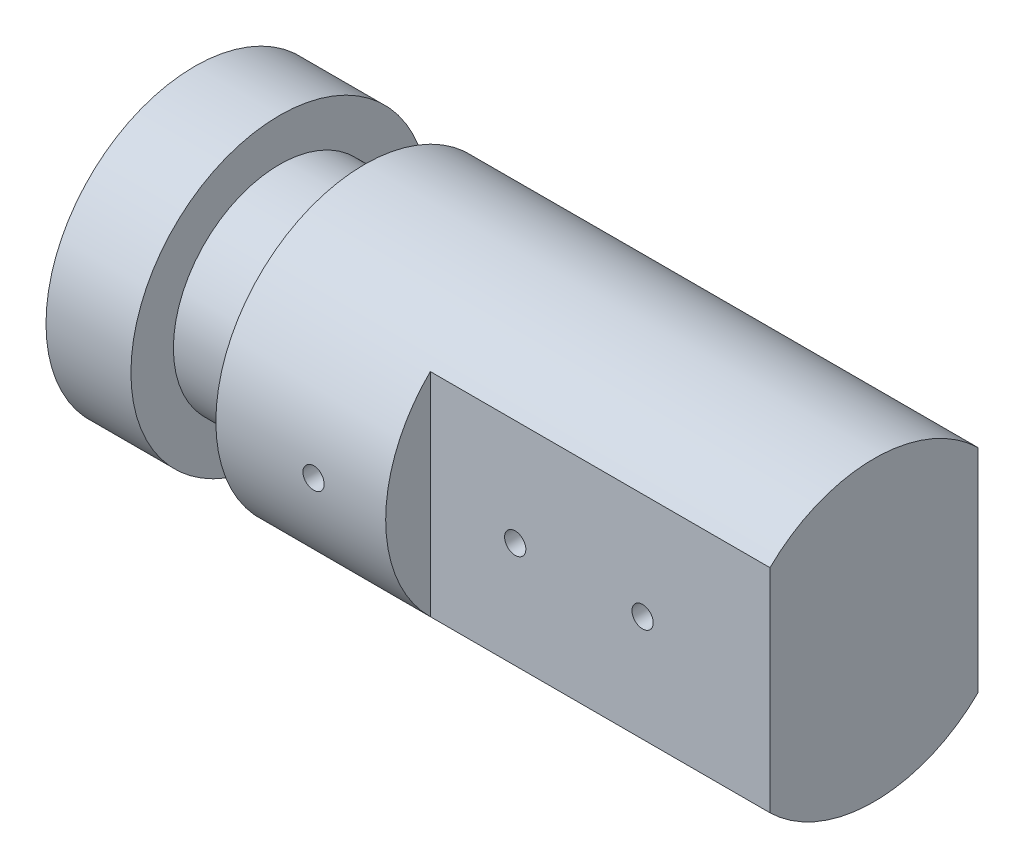
ISO-10303-21;
HEADER;
FILE_DESCRIPTION(('STEP AP214'),'2;1');
FILE_NAME('part.step','',(''),(''),'','','');
FILE_SCHEMA(('AUTOMOTIVE_DESIGN { 1 0 10303 214 1 1 1 1 }'));
ENDSEC;
DATA;
#1=APPLICATION_CONTEXT('core data for automotive mechanical design processes');
#2=APPLICATION_PROTOCOL_DEFINITION('international standard','automotive_design',2000,#1);
#3=PRODUCT_CONTEXT('',#1,'mechanical');
#4=PRODUCT('Part','Part','',(#3));
#5=PRODUCT_RELATED_PRODUCT_CATEGORY('part','',(#4));
#6=PRODUCT_DEFINITION_FORMATION('','',#4);
#7=PRODUCT_DEFINITION_CONTEXT('part definition',#1,'design');
#8=PRODUCT_DEFINITION('design','',#6,#7);
#9=PRODUCT_DEFINITION_SHAPE('','',#8);
#10=(LENGTH_UNIT() NAMED_UNIT(*) SI_UNIT(.MILLI.,.METRE.));
#11=(NAMED_UNIT(*) PLANE_ANGLE_UNIT() SI_UNIT($,.RADIAN.));
#12=(NAMED_UNIT(*) SI_UNIT($,.STERADIAN.) SOLID_ANGLE_UNIT());
#13=UNCERTAINTY_MEASURE_WITH_UNIT(LENGTH_MEASURE(1.E-05),#10,'distance_accuracy_value','');
#14=(GEOMETRIC_REPRESENTATION_CONTEXT(3) GLOBAL_UNCERTAINTY_ASSIGNED_CONTEXT((#13)) GLOBAL_UNIT_ASSIGNED_CONTEXT((#10,
#11,#12)) REPRESENTATION_CONTEXT('',''));
#15=CARTESIAN_POINT('',(0.,0.,0.));
#16=DIRECTION('',(0.,0.,1.));
#17=DIRECTION('',(1.,0.,0.));
#18=AXIS2_PLACEMENT_3D('',#15,#16,#17);
#19=CARTESIAN_POINT('',(40.,17.5,0.));
#20=DIRECTION('',(-1.,0.,0.));
#21=DIRECTION('',(0.,0.,1.));
#22=AXIS2_PLACEMENT_3D('',#19,#20,#21);
#23=PLANE('',#22);
#24=DIRECTION('',(0.,-1.,0.));
#25=VECTOR('',#24,1.);
#26=CARTESIAN_POINT('',(40.,-12.5,12.2474487139159));
#27=LINE('',#26,#25);
#28=CARTESIAN_POINT('',(40.,12.5,12.2474487139159));
#29=VERTEX_POINT('',#28);
#30=CARTESIAN_POINT('',(40.,-12.5,12.2474487139159));
#31=VERTEX_POINT('',#30);
#32=EDGE_CURVE('E139',#29,#31,#27,.T.);
#33=ORIENTED_EDGE('',*,*,#32,.F.);
#34=CARTESIAN_POINT('',(40.,0.,0.));
#35=DIRECTION('',(-1.,0.,0.));
#36=DIRECTION('',(0.,0.,1.));
#37=AXIS2_PLACEMENT_3D('',#34,#35,#36);
#38=CIRCLE('',#37,17.5);
#39=EDGE_CURVE('E62',#31,#29,#38,.T.);
#40=ORIENTED_EDGE('',*,*,#39,.F.);
#41=EDGE_LOOP('',(#33,#40));
#42=FACE_BOUND('',#41,.T.);
#43=ADVANCED_FACE('F43',(#42),#23,.F.);
#44=DIRECTION('',(0.,1.,0.));
#45=VECTOR('',#44,1.);
#46=CARTESIAN_POINT('',(40.,-12.5,-12.2474487139159));
#47=LINE('',#46,#45);
#48=CARTESIAN_POINT('',(40.,-12.5,-12.2474487139159));
#49=VERTEX_POINT('',#48);
#50=CARTESIAN_POINT('',(40.,12.5,-12.2474487139159));
#51=VERTEX_POINT('',#50);
#52=EDGE_CURVE('E69',#49,#51,#47,.T.);
#53=ORIENTED_EDGE('',*,*,#52,.F.);
#54=EDGE_CURVE('E163',#51,#49,#38,.T.);
#55=ORIENTED_EDGE('',*,*,#54,.F.);
#56=EDGE_LOOP('',(#53,#55));
#57=FACE_BOUND('',#56,.T.);
#58=ADVANCED_FACE('F235',(#57),#23,.F.);
#59=CARTESIAN_POINT('',(0.,0.,0.));
#60=DIRECTION('',(1.,0.,0.));
#61=DIRECTION('',(0.,0.,-1.));
#62=AXIS2_PLACEMENT_3D('',#59,#60,#61);
#63=PLANE('',#62);
#64=CARTESIAN_POINT('',(0.,0.,0.));
#65=DIRECTION('',(-1.,0.,0.));
#66=DIRECTION('',(0.,0.,1.));
#67=AXIS2_PLACEMENT_3D('',#64,#65,#66);
#68=CIRCLE('',#67,17.5);
#69=CARTESIAN_POINT('',(0.,0.,17.5));
#70=VERTEX_POINT('',#69);
#71=EDGE_CURVE('E56',#70,#70,#68,.T.);
#72=ORIENTED_EDGE('',*,*,#71,.T.);
#73=EDGE_LOOP('',(#72));
#74=FACE_BOUND('',#73,.T.);
#75=ADVANCED_FACE('F45',(#74),#63,.F.);
#76=CARTESIAN_POINT('',(0.,0.,0.));
#77=DIRECTION('',(-1.,0.,0.));
#78=DIRECTION('',(0.,0.,1.));
#79=AXIS2_PLACEMENT_3D('',#76,#77,#78);
#80=CYLINDRICAL_SURFACE('',#79,17.5);
#81=ORIENTED_EDGE('',*,*,#71,.F.);
#82=EDGE_LOOP('',(#81));
#83=FACE_BOUND('',#82,.T.);
#84=CARTESIAN_POINT('',(10.,0.,0.));
#85=DIRECTION('',(-1.,0.,0.));
#86=DIRECTION('',(0.,0.,1.));
#87=AXIS2_PLACEMENT_3D('',#84,#85,#86);
#88=CIRCLE('',#87,17.5);
#89=CARTESIAN_POINT('',(10.,0.,17.5));
#90=VERTEX_POINT('',#89);
#91=EDGE_CURVE('E173',#90,#90,#88,.T.);
#92=ORIENTED_EDGE('',*,*,#91,.T.);
#93=EDGE_LOOP('',(#92));
#94=FACE_BOUND('',#93,.T.);
#95=ADVANCED_FACE('F179',(#83,#94),#80,.T.);
#96=CARTESIAN_POINT('',(10.,17.5,0.));
#97=DIRECTION('',(-1.,0.,0.));
#98=DIRECTION('',(0.,0.,1.));
#99=AXIS2_PLACEMENT_3D('',#96,#97,#98);
#100=PLANE('',#99);
#101=ORIENTED_EDGE('',*,*,#91,.F.);
#102=EDGE_LOOP('',(#101));
#103=FACE_BOUND('',#102,.T.);
#104=CARTESIAN_POINT('',(10.,0.,0.));
#105=DIRECTION('',(-1.,0.,0.));
#106=DIRECTION('',(0.,0.,1.));
#107=AXIS2_PLACEMENT_3D('',#104,#105,#106);
#108=CIRCLE('',#107,12.5);
#109=CARTESIAN_POINT('',(10.,0.,12.5));
#110=VERTEX_POINT('',#109);
#111=EDGE_CURVE('E170',#110,#110,#108,.T.);
#112=ORIENTED_EDGE('',*,*,#111,.T.);
#113=EDGE_LOOP('',(#112));
#114=FACE_BOUND('',#113,.T.);
#115=ADVANCED_FACE('F182',(#103,#114),#100,.F.);
#116=CARTESIAN_POINT('',(0.,0.,0.));
#117=DIRECTION('',(-1.,0.,0.));
#118=DIRECTION('',(0.,0.,1.));
#119=AXIS2_PLACEMENT_3D('',#116,#117,#118);
#120=CYLINDRICAL_SURFACE('',#119,12.5);
#121=ORIENTED_EDGE('',*,*,#111,.F.);
#122=EDGE_LOOP('',(#121));
#123=FACE_BOUND('',#122,.T.);
#124=CARTESIAN_POINT('',(20.,0.,0.));
#125=DIRECTION('',(-1.,0.,0.));
#126=DIRECTION('',(0.,0.,1.));
#127=AXIS2_PLACEMENT_3D('',#124,#125,#126);
#128=CIRCLE('',#127,12.5);
#129=CARTESIAN_POINT('',(20.,0.,12.5));
#130=VERTEX_POINT('',#129);
#131=EDGE_CURVE('E167',#130,#130,#128,.T.);
#132=ORIENTED_EDGE('',*,*,#131,.T.);
#133=EDGE_LOOP('',(#132));
#134=FACE_BOUND('',#133,.T.);
#135=ADVANCED_FACE('F187',(#123,#134),#120,.T.);
#136=CARTESIAN_POINT('',(20.,12.5,0.));
#137=DIRECTION('',(1.,0.,0.));
#138=DIRECTION('',(0.,0.,-1.));
#139=AXIS2_PLACEMENT_3D('',#136,#137,#138);
#140=PLANE('',#139);
#141=ORIENTED_EDGE('',*,*,#131,.F.);
#142=EDGE_LOOP('',(#141));
#143=FACE_BOUND('',#142,.T.);
#144=CARTESIAN_POINT('',(20.,0.,0.));
#145=DIRECTION('',(-1.,0.,0.));
#146=DIRECTION('',(0.,0.,1.));
#147=AXIS2_PLACEMENT_3D('',#144,#145,#146);
#148=CIRCLE('',#147,17.5);
#149=CARTESIAN_POINT('',(20.,0.,17.5));
#150=VERTEX_POINT('',#149);
#151=EDGE_CURVE('E164',#150,#150,#148,.T.);
#152=ORIENTED_EDGE('',*,*,#151,.T.);
#153=EDGE_LOOP('',(#152));
#154=FACE_BOUND('',#153,.T.);
#155=ADVANCED_FACE('F193',(#143,#154),#140,.F.);
#156=CARTESIAN_POINT('',(0.,0.,0.));
#157=DIRECTION('',(-1.,0.,0.));
#158=DIRECTION('',(0.,0.,1.));
#159=AXIS2_PLACEMENT_3D('',#156,#157,#158);
#160=CYLINDRICAL_SURFACE('',#159,17.5);
#161=CARTESIAN_POINT('',(32.75,0.,17.5));
#162=CARTESIAN_POINT('',(32.7499969233431,-0.070117149484496,17.4999994098506));
#163=CARTESIAN_POINT('',(32.7440804696194,-0.14028285863724,17.4995740919418));
#164=CARTESIAN_POINT('',(32.7205643479706,-0.278675303534782,17.4979183052357));
#165=CARTESIAN_POINT('',(32.7029512242305,-0.346899711636264,17.4966869091517));
#166=CARTESIAN_POINT('',(32.6565515979996,-0.479385006592123,17.4935582109521));
#167=CARTESIAN_POINT('',(32.6277711585204,-0.543648022281689,17.4916612702305));
#168=CARTESIAN_POINT('',(32.5598641138372,-0.666414750875718,17.4874145906709));
#169=CARTESIAN_POINT('',(32.5207398163751,-0.724919744419837,17.4850649528624));
#170=CARTESIAN_POINT('',(32.4331742845642,-0.834637788743854,17.4801717877561));
#171=CARTESIAN_POINT('',(32.3847174095898,-0.885838343544007,17.4776279393593));
#172=CARTESIAN_POINT('',(32.2798948955976,-0.979387078070438,17.4726357811445));
#173=CARTESIAN_POINT('',(32.22352891975,-1.02173488058784,17.4701874754011));
#174=CARTESIAN_POINT('',(32.1044150214231,-1.09641641107241,17.4656599469621));
#175=CARTESIAN_POINT('',(32.0416603873636,-1.12873946032465,17.4635811188462));
#176=CARTESIAN_POINT('',(31.9115974789935,-1.18238568562317,17.4600312453635));
#177=CARTESIAN_POINT('',(31.8442892659998,-1.20370900975475,17.4585601918145));
#178=CARTESIAN_POINT('',(31.7071526806214,-1.23471502929159,17.4563948876015));
#179=CARTESIAN_POINT('',(31.6373288458564,-1.24441769955694,17.4556993041169));
#180=CARTESIAN_POINT('',(31.4970403999725,-1.25196866993374,17.4551593949022));
#181=CARTESIAN_POINT('',(31.4265757979994,-1.24981713898019,17.4553150570408));
#182=CARTESIAN_POINT('',(31.2871424603873,-1.23373732602158,17.4564588484088));
#183=CARTESIAN_POINT('',(31.2181712135936,-1.21983069503747,17.4574454471734));
#184=CARTESIAN_POINT('',(31.0835444608037,-1.18066904472906,17.4601375305538));
#185=CARTESIAN_POINT('',(31.0178889796267,-1.15541394047235,17.46184302055));
#186=CARTESIAN_POINT('',(30.8916881327436,-1.09424779641099,17.4657824650415));
#187=CARTESIAN_POINT('',(30.8311475224627,-1.05832697746606,17.4680169041348));
#188=CARTESIAN_POINT('',(30.7169469354921,-0.976856133947523,17.4727619896942));
#189=CARTESIAN_POINT('',(30.6632870606117,-0.931305966922026,17.475272640246));
#190=CARTESIAN_POINT('',(30.5642452143173,-0.831747687358355,17.4802940380088));
#191=CARTESIAN_POINT('',(30.5188820673649,-0.777720845255675,17.4828047728221));
#192=CARTESIAN_POINT('',(30.4378667064851,-0.66280837237115,17.4875380275495));
#193=CARTESIAN_POINT('',(30.4022144970175,-0.60192273843948,17.4897605473311));
#194=CARTESIAN_POINT('',(30.3416344727459,-0.475009259772344,17.4936672074013));
#195=CARTESIAN_POINT('',(30.3167074184688,-0.408981050765855,17.4953513095081));
#196=CARTESIAN_POINT('',(30.2782981042127,-0.273662021471164,17.4979908920682));
#197=CARTESIAN_POINT('',(30.2648156697278,-0.204371250947024,17.4989463836313));
#198=CARTESIAN_POINT('',(30.2497017458159,-0.0646572718904405,17.5000196537023));
#199=CARTESIAN_POINT('',(30.2480442397022,0.00576310870882634,17.5001392712516));
#200=CARTESIAN_POINT('',(30.256559175733,0.145880835263597,17.4995322145535));
#201=CARTESIAN_POINT('',(30.266731537164,0.215578186148955,17.4988055460801));
#202=CARTESIAN_POINT('',(30.2985959019166,0.352197761007974,17.4965888719432));
#203=CARTESIAN_POINT('',(30.3202759204015,0.419122794226322,17.4950996604993));
#204=CARTESIAN_POINT('',(30.3745279846758,0.548384809855792,17.4915253415958));
#205=CARTESIAN_POINT('',(30.4071001579685,0.610721738548269,17.4894402271606));
#206=CARTESIAN_POINT('',(30.4822778230336,0.729156878244672,17.4849035882871));
#207=CARTESIAN_POINT('',(30.5249006356236,0.785244070228771,17.4824514340036));
#208=CARTESIAN_POINT('',(30.6189445384614,0.88947658177128,17.4774586165239));
#209=CARTESIAN_POINT('',(30.6703657412407,0.937621799736439,17.474917952196));
#210=CARTESIAN_POINT('',(30.7806592704076,1.02469226822026,17.4700290863378));
#211=CARTESIAN_POINT('',(30.8395449703457,1.06360060112515,17.4676812430288));
#212=CARTESIAN_POINT('',(30.9630289906888,1.1309770077119,17.4634485572573));
#213=CARTESIAN_POINT('',(31.0276272671804,1.15944516164002,17.4615637112361));
#214=CARTESIAN_POINT('',(31.1606416853912,1.20510399434882,17.4584721891231));
#215=CARTESIAN_POINT('',(31.229054196316,1.2223052058377,17.4572648797993));
#216=CARTESIAN_POINT('',(31.3678052516375,1.24497623236507,17.4556628449427));
#217=CARTESIAN_POINT('',(31.4381437699037,1.25044620648309,17.4552681083911));
#218=CARTESIAN_POINT('',(31.5785820250946,1.24949784731161,17.4553360073916));
#219=CARTESIAN_POINT('',(31.6486819440432,1.2431061032642,17.4557967253569));
#220=CARTESIAN_POINT('',(31.7868103013997,1.21867099959449,17.457519552287));
#221=CARTESIAN_POINT('',(31.8548387362599,1.20062762001855,17.4587816626242));
#222=CARTESIAN_POINT('',(31.9868960886646,1.15340774176049,17.4619645710358));
#223=CARTESIAN_POINT('',(32.0509251028215,1.12423151213112,17.4638853531917));
#224=CARTESIAN_POINT('',(32.1731798522047,1.05557743800211,17.4681691662485));
#225=CARTESIAN_POINT('',(32.2314057142845,1.01609981875313,17.4705321874791));
#226=CARTESIAN_POINT('',(32.3405368863224,0.927864296995075,17.4754404488947));
#227=CARTESIAN_POINT('',(32.3914264297738,0.879086915481486,17.4779860644277));
#228=CARTESIAN_POINT('',(32.4843140921165,0.773667601821802,17.4829693358859));
#229=CARTESIAN_POINT('',(32.5263100422868,0.717023756985229,17.4854069653642));
#230=CARTESIAN_POINT('',(32.6002591595546,0.597397578294355,17.4899028481879));
#231=CARTESIAN_POINT('',(32.6321973771966,0.53440599110038,17.4919605349398));
#232=CARTESIAN_POINT('',(32.6850042642424,0.403984424460091,17.4954575388478));
#233=CARTESIAN_POINT('',(32.7058858036887,0.336559708476714,17.4968975745809));
#234=CARTESIAN_POINT('',(32.7306021363254,0.223940141045804,17.4986226691958));
#235=CARTESIAN_POINT('',(32.737866826475,0.17947187209296,17.4991368509119));
#236=CARTESIAN_POINT('',(32.7475667414085,0.0900090727581911,17.4998257054331));
#237=CARTESIAN_POINT('',(32.7500019751845,0.045014543356262,17.5000003788703));
#238=CARTESIAN_POINT('',(32.75,0.,17.5));
#239=B_SPLINE_CURVE_WITH_KNOTS('',3,(#161,#162,#163,#164,#165,#166,#167,#168,#169,#170,#171,
#172,#173,#174,#175,#176,#177,#178,#179,#180,#181,#182,#183,#184,#185,#186,#187,#188,#189,#190,
#191,#192,#193,#194,#195,#196,#197,#198,#199,#200,#201,#202,#203,#204,#205,#206,#207,#208,#209,
#210,#211,#212,#213,#214,#215,#216,#217,#218,#219,#220,#221,#222,#223,#224,#225,#226,#227,#228,
#229,#230,#231,#232,#233,#234,#235,#236,#237,#238),.UNSPECIFIED.,.T.,.F.,(4,2,2,2,2,2,2,2,2,2,2,
2,2,2,2,2,2,2,2,2,2,2,2,2,2,2,2,2,2,2,2,2,2,2,2,2,2,2,4),(0.,0.210187109935056,
0.420616438343985,0.630931678969787,0.841200037248038,1.0518239034701,1.26245674238262,
1.47331319011027,1.68416679907991,1.89465744706305,2.10514509533806,2.31524590153536,
2.52534828016136,2.73564389466481,2.94594262039692,3.15671272915215,3.36748293470162,
3.57826808362616,3.78905001847207,3.99936805676206,4.2096846600908,4.41978265430719,
4.62988310801087,4.84034832023193,5.05081622450245,5.26166668296541,5.47251552073596,
5.68316696769573,5.89381555813286,6.10399252868669,6.31416985917359,6.52434211052913,
6.73450976663346,6.94512256839967,7.1557866695467,7.36676243232391,7.57749207511115,
7.71243045265399,7.84736857895633),.UNSPECIFIED.);
#240=CARTESIAN_POINT('',(32.75,0.,17.5));
#241=VERTEX_POINT('',#240);
#242=EDGE_CURVE('E11',#241,#241,#239,.T.);
#243=ORIENTED_EDGE('',*,*,#242,.T.);
#244=EDGE_LOOP('',(#243));
#245=FACE_BOUND('',#244,.T.);
#246=ORIENTED_EDGE('',*,*,#151,.F.);
#247=EDGE_LOOP('',(#246));
#248=FACE_BOUND('',#247,.T.);
#249=ORIENTED_EDGE('',*,*,#39,.T.);
#250=DIRECTION('',(-1.,0.,0.));
#251=VECTOR('',#250,1.);
#252=CARTESIAN_POINT('',(80.,12.5,12.2474487139159));
#253=LINE('',#252,#251);
#254=CARTESIAN_POINT('',(80.,12.5,12.2474487139159));
#255=VERTEX_POINT('',#254);
#256=EDGE_CURVE('E150',#255,#29,#253,.T.);
#257=ORIENTED_EDGE('',*,*,#256,.F.);
#258=CARTESIAN_POINT('',(80.,0.,0.));
#259=DIRECTION('',(1.,0.,0.));
#260=DIRECTION('',(0.,0.,-1.));
#261=AXIS2_PLACEMENT_3D('',#258,#259,#260);
#262=CIRCLE('',#261,17.5);
#263=CARTESIAN_POINT('',(80.,12.5,-12.2474487139159));
#264=VERTEX_POINT('',#263);
#265=EDGE_CURVE('E141',#264,#255,#262,.T.);
#266=ORIENTED_EDGE('',*,*,#265,.F.);
#267=DIRECTION('',(-1.,0.,0.));
#268=VECTOR('',#267,1.);
#269=CARTESIAN_POINT('',(80.,12.5,-12.2474487139159));
#270=LINE('',#269,#268);
#271=EDGE_CURVE('E153',#264,#51,#270,.T.);
#272=ORIENTED_EDGE('',*,*,#271,.T.);
#273=ORIENTED_EDGE('',*,*,#54,.T.);
#274=DIRECTION('',(-1.,0.,0.));
#275=VECTOR('',#274,1.);
#276=CARTESIAN_POINT('',(80.,-12.5,-12.2474487139159));
#277=LINE('',#276,#275);
#278=CARTESIAN_POINT('',(80.,-12.5,-12.2474487139159));
#279=VERTEX_POINT('',#278);
#280=EDGE_CURVE('E156',#279,#49,#277,.T.);
#281=ORIENTED_EDGE('',*,*,#280,.F.);
#282=CARTESIAN_POINT('',(80.,0.,0.));
#283=DIRECTION('',(1.,0.,0.));
#284=DIRECTION('',(0.,0.,-1.));
#285=AXIS2_PLACEMENT_3D('',#282,#283,#284);
#286=CIRCLE('',#285,17.5);
#287=CARTESIAN_POINT('',(80.,-12.5,12.2474487139159));
#288=VERTEX_POINT('',#287);
#289=EDGE_CURVE('E135',#288,#279,#286,.T.);
#290=ORIENTED_EDGE('',*,*,#289,.F.);
#291=DIRECTION('',(-1.,0.,0.));
#292=VECTOR('',#291,1.);
#293=CARTESIAN_POINT('',(80.,-12.5,12.2474487139159));
#294=LINE('',#293,#292);
#295=EDGE_CURVE('E145',#288,#31,#294,.T.);
#296=ORIENTED_EDGE('',*,*,#295,.T.);
#297=EDGE_LOOP('',(#249,#257,#266,#272,#273,#281,#290,#296));
#298=FACE_BOUND('',#297,.T.);
#299=ADVANCED_FACE('F199',(#245,#248,#298),#160,.T.);
#300=CARTESIAN_POINT('',(31.5,0.,17.5));
#301=DIRECTION('',(0.,0.,1.));
#302=DIRECTION('',(1.,0.,0.));
#303=AXIS2_PLACEMENT_3D('',#300,#301,#302);
#304=CYLINDRICAL_SURFACE('',#303,1.25);
#305=CARTESIAN_POINT('',(31.5,0.,14.2510757737845));
#306=DIRECTION('',(0.,0.,1.));
#307=DIRECTION('',(1.,0.,0.));
#308=AXIS2_PLACEMENT_3D('',#305,#306,#307);
#309=CIRCLE('',#308,1.25);
#310=CARTESIAN_POINT('',(32.75,0.,14.2510757737845));
#311=VERTEX_POINT('',#310);
#312=EDGE_CURVE('E159',#311,#311,#309,.T.);
#313=ORIENTED_EDGE('',*,*,#312,.F.);
#314=EDGE_LOOP('',(#313));
#315=FACE_BOUND('',#314,.T.);
#316=ORIENTED_EDGE('',*,*,#242,.F.);
#317=EDGE_LOOP('',(#316));
#318=FACE_BOUND('',#317,.T.);
#319=ADVANCED_FACE('F205',(#315,#318),#304,.F.);
#320=CARTESIAN_POINT('',(31.5,0.,14.2510757737845));
#321=DIRECTION('',(0.,0.,1.));
#322=DIRECTION('',(1.,0.,0.));
#323=AXIS2_PLACEMENT_3D('',#320,#321,#322);
#324=CONICAL_SURFACE('',#323,1.25,1.02974425867666);
#325=CARTESIAN_POINT('',(31.5,0.,13.5));
#326=VERTEX_POINT('',#325);
#327=VERTEX_LOOP('',#326);
#328=FACE_BOUND('',#327,.T.);
#329=ORIENTED_EDGE('',*,*,#312,.T.);
#330=EDGE_LOOP('',(#329));
#331=FACE_BOUND('',#330,.T.);
#332=ADVANCED_FACE('F221',(#328,#331),#324,.F.);
#333=CARTESIAN_POINT('',(80.,-12.5,-12.2474487139159));
#334=DIRECTION('',(0.,0.,1.));
#335=DIRECTION('',(1.,0.,0.));
#336=AXIS2_PLACEMENT_3D('',#333,#334,#335);
#337=PLANE('',#336);
#338=CARTESIAN_POINT('',(65.,0.,-12.2474487139159));
#339=DIRECTION('',(0.,0.,-1.));
#340=DIRECTION('',(-1.,0.,0.));
#341=AXIS2_PLACEMENT_3D('',#338,#339,#340);
#342=CIRCLE('',#341,1.24999999999999);
#343=CARTESIAN_POINT('',(63.75,0.,-12.2474487139159));
#344=VERTEX_POINT('',#343);
#345=EDGE_CURVE('E123',#344,#344,#342,.T.);
#346=ORIENTED_EDGE('',*,*,#345,.F.);
#347=EDGE_LOOP('',(#346));
#348=FACE_BOUND('',#347,.T.);
#349=CARTESIAN_POINT('',(50.,0.,-12.2474487139159));
#350=DIRECTION('',(0.,0.,-1.));
#351=DIRECTION('',(-1.,0.,0.));
#352=AXIS2_PLACEMENT_3D('',#349,#350,#351);
#353=CIRCLE('',#352,1.24999999999999);
#354=CARTESIAN_POINT('',(48.75,0.,-12.2474487139159));
#355=VERTEX_POINT('',#354);
#356=EDGE_CURVE('E129',#355,#355,#353,.T.);
#357=ORIENTED_EDGE('',*,*,#356,.F.);
#358=EDGE_LOOP('',(#357));
#359=FACE_BOUND('',#358,.T.);
#360=ORIENTED_EDGE('',*,*,#52,.T.);
#361=ORIENTED_EDGE('',*,*,#271,.F.);
#362=DIRECTION('',(0.,1.,0.));
#363=VECTOR('',#362,1.);
#364=CARTESIAN_POINT('',(80.,-12.5,-12.2474487139159));
#365=LINE('',#364,#363);
#366=EDGE_CURVE('E138',#279,#264,#365,.T.);
#367=ORIENTED_EDGE('',*,*,#366,.F.);
#368=ORIENTED_EDGE('',*,*,#280,.T.);
#369=EDGE_LOOP('',(#360,#361,#367,#368));
#370=FACE_BOUND('',#369,.T.);
#371=ADVANCED_FACE('F219',(#348,#359,#370),#337,.F.);
#372=CARTESIAN_POINT('',(80.,-12.5,12.2474487139159));
#373=DIRECTION('',(0.,0.,-1.));
#374=DIRECTION('',(-1.,0.,0.));
#375=AXIS2_PLACEMENT_3D('',#372,#373,#374);
#376=PLANE('',#375);
#377=CARTESIAN_POINT('',(50.,0.,12.2474487139159));
#378=DIRECTION('',(0.,0.,1.));
#379=DIRECTION('',(1.,0.,0.));
#380=AXIS2_PLACEMENT_3D('',#377,#378,#379);
#381=CIRCLE('',#380,1.24999999999999);
#382=CARTESIAN_POINT('',(51.25,0.,12.2474487139159));
#383=VERTEX_POINT('',#382);
#384=EDGE_CURVE('E113',#383,#383,#381,.T.);
#385=ORIENTED_EDGE('',*,*,#384,.F.);
#386=EDGE_LOOP('',(#385));
#387=FACE_BOUND('',#386,.T.);
#388=CARTESIAN_POINT('',(65.,0.,12.2474487139159));
#389=DIRECTION('',(0.,0.,1.));
#390=DIRECTION('',(1.,0.,0.));
#391=AXIS2_PLACEMENT_3D('',#388,#389,#390);
#392=CIRCLE('',#391,1.24999999999999);
#393=CARTESIAN_POINT('',(66.25,0.,12.2474487139159));
#394=VERTEX_POINT('',#393);
#395=EDGE_CURVE('E112',#394,#394,#392,.T.);
#396=ORIENTED_EDGE('',*,*,#395,.F.);
#397=EDGE_LOOP('',(#396));
#398=FACE_BOUND('',#397,.T.);
#399=ORIENTED_EDGE('',*,*,#32,.T.);
#400=ORIENTED_EDGE('',*,*,#295,.F.);
#401=DIRECTION('',(0.,-1.,0.));
#402=VECTOR('',#401,1.);
#403=CARTESIAN_POINT('',(80.,-12.5,12.2474487139159));
#404=LINE('',#403,#402);
#405=EDGE_CURVE('E143',#255,#288,#404,.T.);
#406=ORIENTED_EDGE('',*,*,#405,.F.);
#407=ORIENTED_EDGE('',*,*,#256,.T.);
#408=EDGE_LOOP('',(#399,#400,#406,#407));
#409=FACE_BOUND('',#408,.T.);
#410=ADVANCED_FACE('F213',(#387,#398,#409),#376,.F.);
#411=CARTESIAN_POINT('',(80.,0.,0.));
#412=DIRECTION('',(1.,0.,0.));
#413=DIRECTION('',(0.,0.,-1.));
#414=AXIS2_PLACEMENT_3D('',#411,#412,#413);
#415=PLANE('',#414);
#416=ORIENTED_EDGE('',*,*,#289,.T.);
#417=ORIENTED_EDGE('',*,*,#366,.T.);
#418=ORIENTED_EDGE('',*,*,#265,.T.);
#419=ORIENTED_EDGE('',*,*,#405,.T.);
#420=EDGE_LOOP('',(#416,#417,#418,#419));
#421=FACE_BOUND('',#420,.T.);
#422=ADVANCED_FACE('F215',(#421),#415,.T.);
#423=CARTESIAN_POINT('',(50.,0.,-7.24744871391589));
#424=DIRECTION('',(0.,0.,-1.));
#425=DIRECTION('',(-1.,0.,0.));
#426=AXIS2_PLACEMENT_3D('',#423,#424,#425);
#427=CONICAL_SURFACE('',#426,1.25,1.02974425867665);
#428=CARTESIAN_POINT('',(50.,0.,-6.49637294013144));
#429=VERTEX_POINT('',#428);
#430=VERTEX_LOOP('',#429);
#431=FACE_BOUND('',#430,.T.);
#432=CARTESIAN_POINT('',(50.,0.,-7.24744871391589));
#433=DIRECTION('',(0.,0.,-1.));
#434=DIRECTION('',(-1.,0.,0.));
#435=AXIS2_PLACEMENT_3D('',#432,#433,#434);
#436=CIRCLE('',#435,1.25);
#437=CARTESIAN_POINT('',(48.75,0.,-7.24744871391589));
#438=VERTEX_POINT('',#437);
#439=EDGE_CURVE('E132',#438,#438,#436,.T.);
#440=ORIENTED_EDGE('',*,*,#439,.T.);
#441=EDGE_LOOP('',(#440));
#442=FACE_BOUND('',#441,.T.);
#443=ADVANCED_FACE('F290',(#431,#442),#427,.F.);
#444=CARTESIAN_POINT('',(50.,0.,-12.2474487139159));
#445=DIRECTION('',(0.,0.,-1.));
#446=DIRECTION('',(-1.,0.,0.));
#447=AXIS2_PLACEMENT_3D('',#444,#445,#446);
#448=CYLINDRICAL_SURFACE('',#447,1.24999999999999);
#449=ORIENTED_EDGE('',*,*,#439,.F.);
#450=EDGE_LOOP('',(#449));
#451=FACE_BOUND('',#450,.T.);
#452=ORIENTED_EDGE('',*,*,#356,.T.);
#453=EDGE_LOOP('',(#452));
#454=FACE_BOUND('',#453,.T.);
#455=ADVANCED_FACE('F317',(#451,#454),#448,.F.);
#456=CARTESIAN_POINT('',(65.,0.,-7.24744871391589));
#457=DIRECTION('',(0.,0.,-1.));
#458=DIRECTION('',(-1.,0.,0.));
#459=AXIS2_PLACEMENT_3D('',#456,#457,#458);
#460=CONICAL_SURFACE('',#459,1.25,1.02974425867665);
#461=CARTESIAN_POINT('',(65.,0.,-6.49637294013144));
#462=VERTEX_POINT('',#461);
#463=VERTEX_LOOP('',#462);
#464=FACE_BOUND('',#463,.T.);
#465=CARTESIAN_POINT('',(65.,0.,-7.24744871391589));
#466=DIRECTION('',(0.,0.,-1.));
#467=DIRECTION('',(-1.,0.,0.));
#468=AXIS2_PLACEMENT_3D('',#465,#466,#467);
#469=CIRCLE('',#468,1.25);
#470=CARTESIAN_POINT('',(63.75,0.,-7.24744871391589));
#471=VERTEX_POINT('',#470);
#472=EDGE_CURVE('E126',#471,#471,#469,.T.);
#473=ORIENTED_EDGE('',*,*,#472,.T.);
#474=EDGE_LOOP('',(#473));
#475=FACE_BOUND('',#474,.T.);
#476=ADVANCED_FACE('F329',(#464,#475),#460,.F.);
#477=CARTESIAN_POINT('',(65.,0.,-12.2474487139159));
#478=DIRECTION('',(0.,0.,-1.));
#479=DIRECTION('',(-1.,0.,0.));
#480=AXIS2_PLACEMENT_3D('',#477,#478,#479);
#481=CYLINDRICAL_SURFACE('',#480,1.24999999999999);
#482=ORIENTED_EDGE('',*,*,#472,.F.);
#483=EDGE_LOOP('',(#482));
#484=FACE_BOUND('',#483,.T.);
#485=ORIENTED_EDGE('',*,*,#345,.T.);
#486=EDGE_LOOP('',(#485));
#487=FACE_BOUND('',#486,.T.);
#488=ADVANCED_FACE('F341',(#484,#487),#481,.F.);
#489=CARTESIAN_POINT('',(65.,0.,7.24744871391589));
#490=DIRECTION('',(0.,0.,1.));
#491=DIRECTION('',(1.,0.,0.));
#492=AXIS2_PLACEMENT_3D('',#489,#490,#491);
#493=CONICAL_SURFACE('',#492,1.25,1.02974425867665);
#494=CARTESIAN_POINT('',(65.,0.,6.49637294013144));
#495=VERTEX_POINT('',#494);
#496=VERTEX_LOOP('',#495);
#497=FACE_BOUND('',#496,.T.);
#498=CARTESIAN_POINT('',(65.,0.,7.24744871391589));
#499=DIRECTION('',(0.,0.,1.));
#500=DIRECTION('',(1.,0.,0.));
#501=AXIS2_PLACEMENT_3D('',#498,#499,#500);
#502=CIRCLE('',#501,1.25);
#503=CARTESIAN_POINT('',(66.25,0.,7.24744871391589));
#504=VERTEX_POINT('',#503);
#505=EDGE_CURVE('E116',#504,#504,#502,.T.);
#506=ORIENTED_EDGE('',*,*,#505,.T.);
#507=EDGE_LOOP('',(#506));
#508=FACE_BOUND('',#507,.T.);
#509=ADVANCED_FACE('F352',(#497,#508),#493,.F.);
#510=CARTESIAN_POINT('',(65.,0.,12.2474487139159));
#511=DIRECTION('',(0.,0.,1.));
#512=DIRECTION('',(1.,0.,0.));
#513=AXIS2_PLACEMENT_3D('',#510,#511,#512);
#514=CYLINDRICAL_SURFACE('',#513,1.24999999999999);
#515=ORIENTED_EDGE('',*,*,#505,.F.);
#516=EDGE_LOOP('',(#515));
#517=FACE_BOUND('',#516,.T.);
#518=ORIENTED_EDGE('',*,*,#395,.T.);
#519=EDGE_LOOP('',(#518));
#520=FACE_BOUND('',#519,.T.);
#521=ADVANCED_FACE('F106',(#517,#520),#514,.F.);
#522=CARTESIAN_POINT('',(50.,0.,7.24744871391589));
#523=DIRECTION('',(0.,0.,1.));
#524=DIRECTION('',(1.,0.,0.));
#525=AXIS2_PLACEMENT_3D('',#522,#523,#524);
#526=CONICAL_SURFACE('',#525,1.25,1.02974425867665);
#527=CARTESIAN_POINT('',(50.,0.,6.49637294013144));
#528=VERTEX_POINT('',#527);
#529=VERTEX_LOOP('',#528);
#530=FACE_BOUND('',#529,.T.);
#531=CARTESIAN_POINT('',(50.,0.,7.24744871391589));
#532=DIRECTION('',(0.,0.,1.));
#533=DIRECTION('',(1.,0.,0.));
#534=AXIS2_PLACEMENT_3D('',#531,#532,#533);
#535=CIRCLE('',#534,1.25);
#536=CARTESIAN_POINT('',(51.25,0.,7.24744871391589));
#537=VERTEX_POINT('',#536);
#538=EDGE_CURVE('E110',#537,#537,#535,.T.);
#539=ORIENTED_EDGE('',*,*,#538,.T.);
#540=EDGE_LOOP('',(#539));
#541=FACE_BOUND('',#540,.T.);
#542=ADVANCED_FACE('F102',(#530,#541),#526,.F.);
#543=CARTESIAN_POINT('',(50.,0.,12.2474487139159));
#544=DIRECTION('',(0.,0.,1.));
#545=DIRECTION('',(1.,0.,0.));
#546=AXIS2_PLACEMENT_3D('',#543,#544,#545);
#547=CYLINDRICAL_SURFACE('',#546,1.24999999999999);
#548=ORIENTED_EDGE('',*,*,#538,.F.);
#549=EDGE_LOOP('',(#548));
#550=FACE_BOUND('',#549,.T.);
#551=ORIENTED_EDGE('',*,*,#384,.T.);
#552=EDGE_LOOP('',(#551));
#553=FACE_BOUND('',#552,.T.);
#554=ADVANCED_FACE('F105',(#550,#553),#547,.F.);
#555=CLOSED_SHELL('',(#43,#58,#75,#95,#115,#135,#155,#299,#319,#332,#371,#410,#422,#443,#455,
#476,#488,#509,#521,#542,#554));
#556=MANIFOLD_SOLID_BREP('B2',#555);
#557=ADVANCED_BREP_SHAPE_REPRESENTATION('',(#18,#556),#14);
#558=SHAPE_DEFINITION_REPRESENTATION(#9,#557);
ENDSEC;
END-ISO-10303-21;
